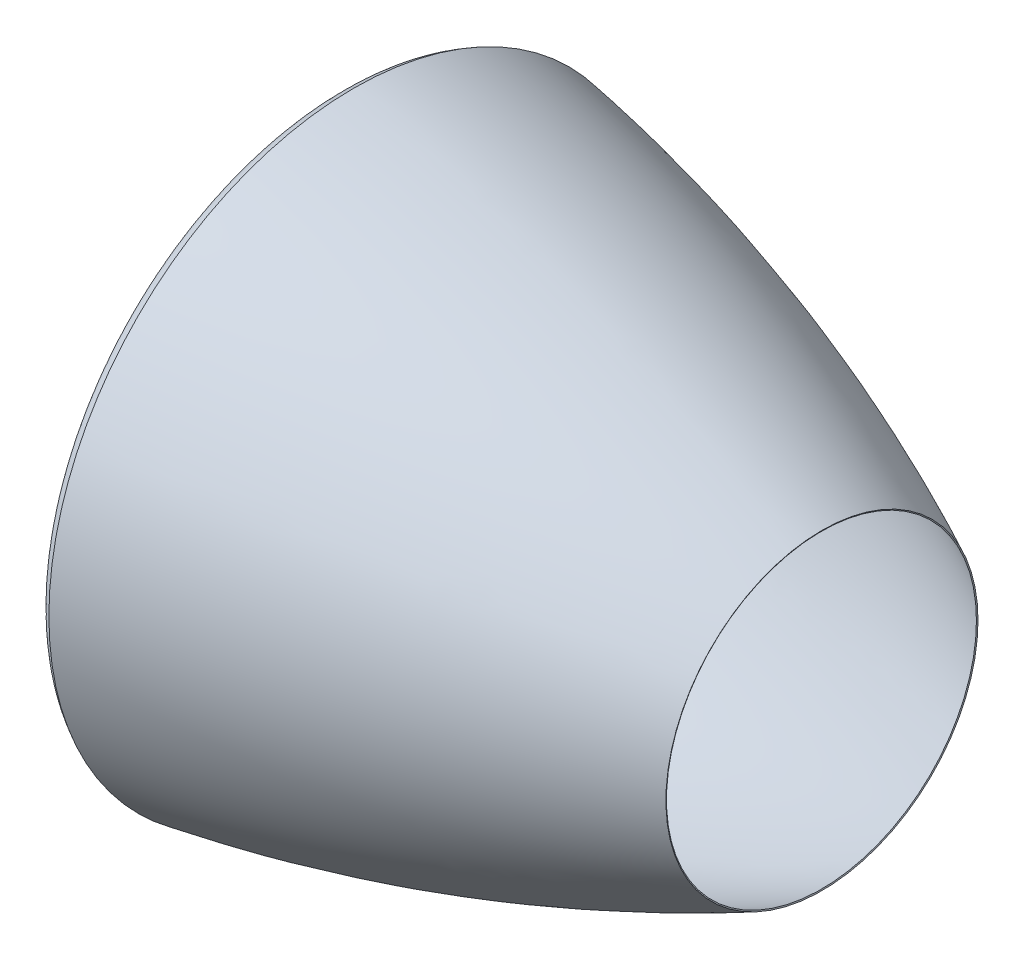
ISO-10303-21;
HEADER;
FILE_DESCRIPTION(('STEP AP214'),'2;1');
FILE_NAME('part.step','',(''),(''),'','','');
FILE_SCHEMA(('AUTOMOTIVE_DESIGN { 1 0 10303 214 1 1 1 1 }'));
ENDSEC;
DATA;
#1=APPLICATION_CONTEXT('core data for automotive mechanical design processes');
#2=APPLICATION_PROTOCOL_DEFINITION('international standard','automotive_design',2000,#1);
#3=PRODUCT_CONTEXT('',#1,'mechanical');
#4=PRODUCT('Part','Part','',(#3));
#5=PRODUCT_RELATED_PRODUCT_CATEGORY('part','',(#4));
#6=PRODUCT_DEFINITION_FORMATION('','',#4);
#7=PRODUCT_DEFINITION_CONTEXT('part definition',#1,'design');
#8=PRODUCT_DEFINITION('design','',#6,#7);
#9=PRODUCT_DEFINITION_SHAPE('','',#8);
#10=(LENGTH_UNIT() NAMED_UNIT(*) SI_UNIT(.MILLI.,.METRE.));
#11=(NAMED_UNIT(*) PLANE_ANGLE_UNIT() SI_UNIT($,.RADIAN.));
#12=(NAMED_UNIT(*) SI_UNIT($,.STERADIAN.) SOLID_ANGLE_UNIT());
#13=UNCERTAINTY_MEASURE_WITH_UNIT(LENGTH_MEASURE(1.E-05),#10,'distance_accuracy_value','');
#14=(GEOMETRIC_REPRESENTATION_CONTEXT(3) GLOBAL_UNCERTAINTY_ASSIGNED_CONTEXT((#13)) GLOBAL_UNIT_ASSIGNED_CONTEXT((#10,
#11,#12)) REPRESENTATION_CONTEXT('',''));
#15=CARTESIAN_POINT('',(0.,0.,0.));
#16=DIRECTION('',(0.,0.,1.));
#17=DIRECTION('',(1.,0.,0.));
#18=AXIS2_PLACEMENT_3D('',#15,#16,#17);
#19=CARTESIAN_POINT('',(58.1645223558109,0.,0.));
#20=DIRECTION('',(-1.,0.,0.));
#21=DIRECTION('',(0.,0.,1.));
#22=AXIS2_PLACEMENT_3D('',#19,#20,#21);
#23=PLANE('',#22);
#24=CARTESIAN_POINT('',(58.1645223558109,0.,0.));
#25=DIRECTION('',(1.,0.,0.));
#26=DIRECTION('',(0.,0.,-1.));
#27=AXIS2_PLACEMENT_3D('',#24,#25,#26);
#28=CIRCLE('',#27,1245.);
#29=CARTESIAN_POINT('',(58.1645223558109,0.,-1245.));
#30=VERTEX_POINT('',#29);
#31=EDGE_CURVE('E51',#30,#30,#28,.T.);
#32=ORIENTED_EDGE('',*,*,#31,.F.);
#33=EDGE_LOOP('',(#32));
#34=FACE_BOUND('',#33,.T.);
#35=CARTESIAN_POINT('',(58.1645223558109,0.,0.));
#36=DIRECTION('',(1.,0.,0.));
#37=DIRECTION('',(0.,0.,-1.));
#38=AXIS2_PLACEMENT_3D('',#35,#36,#37);
#39=CIRCLE('',#38,1250.);
#40=CARTESIAN_POINT('',(58.1645223558109,0.,-1250.));
#41=VERTEX_POINT('',#40);
#42=EDGE_CURVE('E114',#41,#41,#39,.T.);
#43=ORIENTED_EDGE('',*,*,#42,.T.);
#44=EDGE_LOOP('',(#43));
#45=FACE_BOUND('',#44,.T.);
#46=ADVANCED_FACE('F33',(#34,#45),#23,.F.);
#47=CARTESIAN_POINT('',(2000.,0.,0.));
#48=DIRECTION('',(1.,0.,0.));
#49=DIRECTION('',(0.,0.,-1.));
#50=AXIS2_PLACEMENT_3D('',#47,#48,#49);
#51=CONICAL_SURFACE('',#50,663.,1.11948333042552);
#52=CARTESIAN_POINT('',(2002.18073721308,0.,0.));
#53=DIRECTION('',(1.,0.,0.));
#54=DIRECTION('',(0.,1.,0.));
#55=AXIS2_PLACEMENT_3D('',#52,#53,#54);
#56=CIRCLE('',#55,667.499376090913);
#57=CARTESIAN_POINT('',(2002.18073721308,667.499376090913,0.));
#58=VERTEX_POINT('',#57);
#59=EDGE_CURVE('E10',#58,#58,#56,.T.);
#60=ORIENTED_EDGE('',*,*,#59,.T.);
#61=EDGE_LOOP('',(#60));
#62=FACE_BOUND('',#61,.T.);
#63=CARTESIAN_POINT('',(2000.,0.,0.));
#64=DIRECTION('',(1.,0.,0.));
#65=DIRECTION('',(0.,0.,-1.));
#66=AXIS2_PLACEMENT_3D('',#63,#64,#65);
#67=CIRCLE('',#66,663.);
#68=CARTESIAN_POINT('',(2000.,0.,-663.));
#69=VERTEX_POINT('',#68);
#70=EDGE_CURVE('E36',#69,#69,#67,.T.);
#71=ORIENTED_EDGE('',*,*,#70,.F.);
#72=EDGE_LOOP('',(#71));
#73=FACE_BOUND('',#72,.T.);
#74=ADVANCED_FACE('F150',(#62,#73),#51,.F.);
#75=CARTESIAN_POINT('',(2000.,663.,0.));
#76=CARTESIAN_POINT('',(1038.41146312388,1129.0583742429,0.));
#77=CARTESIAN_POINT('',(-10.3841146312388,1300.40536778039,0.));
#78=CARTESIAN_POINT('',(-20.7682292624776,1302.1018726669,0.));
#79=B_SPLINE_CURVE_WITH_KNOTS('',2,(#75,#76,#77,#78),.UNSPECIFIED.,.F.,.F.,(3,1,3),(0.,1.,1.01),.UNSPECIFIED.);
#80=CARTESIAN_POINT('',(0.,0.,0.));
#81=DIRECTION('',(1.,0.,0.));
#82=AXIS1_PLACEMENT('',#80,#81);
#83=SURFACE_OF_REVOLUTION('',#79,#82);
#84=OFFSET_SURFACE('',#83,-5.,.F.);
#85=CARTESIAN_POINT('',(-0.811020893529139,0.,0.));
#86=DIRECTION('',(1.,0.,0.));
#87=DIRECTION('',(0.,0.,-1.));
#88=AXIS2_PLACEMENT_3D('',#85,#86,#87);
#89=CIRCLE('',#88,1303.90765250978);
#90=CARTESIAN_POINT('',(-0.811020893529139,0.,-1303.90765250978));
#91=VERTEX_POINT('',#90);
#92=EDGE_CURVE('E40',#91,#91,#89,.T.);
#93=ORIENTED_EDGE('',*,*,#92,.T.);
#94=EDGE_LOOP('',(#93));
#95=FACE_BOUND('',#94,.T.);
#96=ORIENTED_EDGE('',*,*,#59,.F.);
#97=EDGE_LOOP('',(#96));
#98=FACE_BOUND('',#97,.T.);
#99=ADVANCED_FACE('F70',(#95,#98),#84,.F.);
#100=CARTESIAN_POINT('',(1.91173018426842,1299.68345446852,0.));
#101=CARTESIAN_POINT('',(0.955865092134211,1299.1961586812,0.));
#102=CARTESIAN_POINT('',(-95.5865092134211,1249.97928416188,0.));
#103=CARTESIAN_POINT('',(0.955865092134211,1199.50020715838,0.));
#104=CARTESIAN_POINT('',(1.91173018426842,1199.00041431676,0.));
#105=B_SPLINE_CURVE_WITH_KNOTS('',2,(#100,#101,#102,#103,#104),.UNSPECIFIED.,.F.,.F.,(3,1,1,3),
(-0.01,0.,1.,1.01),.UNSPECIFIED.);
#106=CARTESIAN_POINT('',(0.,0.,0.));
#107=DIRECTION('',(1.,0.,0.));
#108=AXIS1_PLACEMENT('',#106,#107);
#109=SURFACE_OF_REVOLUTION('',#105,#108);
#110=OFFSET_SURFACE('',#109,-5.,.F.);
#111=CARTESIAN_POINT('',(-1.22828908007919,0.,0.));
#112=DIRECTION('',(1.,0.,0.));
#113=DIRECTION('',(0.,0.,-1.));
#114=AXIS2_PLACEMENT_3D('',#111,#112,#113);
#115=CIRCLE('',#114,1195.);
#116=CARTESIAN_POINT('',(-1.22828908007919,0.,-1195.));
#117=VERTEX_POINT('',#116);
#118=EDGE_CURVE('E45',#117,#117,#115,.T.);
#119=ORIENTED_EDGE('',*,*,#118,.T.);
#120=EDGE_LOOP('',(#119));
#121=FACE_BOUND('',#120,.T.);
#122=ORIENTED_EDGE('',*,*,#92,.F.);
#123=EDGE_LOOP('',(#122));
#124=FACE_BOUND('',#123,.T.);
#125=ADVANCED_FACE('F71',(#121,#124),#110,.F.);
#126=CARTESIAN_POINT('',(0.,0.,0.));
#127=DIRECTION('',(1.,0.,0.));
#128=DIRECTION('',(0.,0.,-1.));
#129=AXIS2_PLACEMENT_3D('',#126,#127,#128);
#130=CYLINDRICAL_SURFACE('',#129,1195.);
#131=CARTESIAN_POINT('',(29.2497686688985,0.,0.));
#132=DIRECTION('',(1.,0.,0.));
#133=DIRECTION('',(0.,0.,-1.));
#134=AXIS2_PLACEMENT_3D('',#131,#132,#133);
#135=CIRCLE('',#134,1195.);
#136=CARTESIAN_POINT('',(29.2497686688985,0.,-1195.));
#137=VERTEX_POINT('',#136);
#138=EDGE_CURVE('E54',#137,#137,#135,.T.);
#139=ORIENTED_EDGE('',*,*,#138,.T.);
#140=EDGE_LOOP('',(#139));
#141=FACE_BOUND('',#140,.T.);
#142=ORIENTED_EDGE('',*,*,#118,.F.);
#143=EDGE_LOOP('',(#142));
#144=FACE_BOUND('',#143,.T.);
#145=ADVANCED_FACE('F74',(#141,#144),#130,.F.);
#146=CARTESIAN_POINT('',(29.9346446732899,0.,0.));
#147=DIRECTION('',(1.,0.,0.));
#148=DIRECTION('',(0.,0.,-1.));
#149=AXIS2_PLACEMENT_3D('',#146,#147,#148);
#150=CONICAL_SURFACE('',#149,1199.19421966494,1.40893440740853);
#151=CARTESIAN_POINT('',(37.4142910247094,0.,0.));
#152=DIRECTION('',(1.,0.,0.));
#153=DIRECTION('',(0.,0.,-1.));
#154=AXIS2_PLACEMENT_3D('',#151,#152,#153);
#155=CIRCLE('',#154,1245.);
#156=CARTESIAN_POINT('',(37.4142910247094,0.,-1245.));
#157=VERTEX_POINT('',#156);
#158=EDGE_CURVE('E49',#157,#157,#155,.T.);
#159=ORIENTED_EDGE('',*,*,#158,.T.);
#160=EDGE_LOOP('',(#159));
#161=FACE_BOUND('',#160,.T.);
#162=ORIENTED_EDGE('',*,*,#138,.F.);
#163=EDGE_LOOP('',(#162));
#164=FACE_BOUND('',#163,.T.);
#165=ADVANCED_FACE('F80',(#161,#164),#150,.F.);
#166=CARTESIAN_POINT('',(0.,0.,0.));
#167=DIRECTION('',(1.,0.,0.));
#168=DIRECTION('',(0.,0.,-1.));
#169=AXIS2_PLACEMENT_3D('',#166,#167,#168);
#170=CYLINDRICAL_SURFACE('',#169,1245.);
#171=ORIENTED_EDGE('',*,*,#31,.T.);
#172=EDGE_LOOP('',(#171));
#173=FACE_BOUND('',#172,.T.);
#174=ORIENTED_EDGE('',*,*,#158,.F.);
#175=EDGE_LOOP('',(#174));
#176=FACE_BOUND('',#175,.T.);
#177=ADVANCED_FACE('F84',(#173,#176),#170,.F.);
#178=CARTESIAN_POINT('',(2000.,663.,0.));
#179=CARTESIAN_POINT('',(1038.41146312388,1129.0583742429,0.));
#180=CARTESIAN_POINT('',(0.,1298.70886289388,0.));
#181=B_SPLINE_CURVE_WITH_KNOTS('',2,(#178,#179,#180),.UNSPECIFIED.,.F.,.F.,(3,3),(0.,1.),.UNSPECIFIED.);
#182=CARTESIAN_POINT('',(0.,0.,0.));
#183=DIRECTION('',(1.,0.,0.));
#184=AXIS1_PLACEMENT('',#182,#183);
#185=SURFACE_OF_REVOLUTION('',#181,#184);
#186=CARTESIAN_POINT('',(0.,0.,0.));
#187=DIRECTION('',(1.,0.,0.));
#188=DIRECTION('',(0.,0.,-1.));
#189=AXIS2_PLACEMENT_3D('',#186,#187,#188);
#190=CIRCLE('',#189,1298.70886289388);
#191=CARTESIAN_POINT('',(0.,0.,-1298.70886289388));
#192=VERTEX_POINT('',#191);
#193=EDGE_CURVE('E128',#192,#192,#190,.T.);
#194=ORIENTED_EDGE('',*,*,#193,.F.);
#195=EDGE_LOOP('',(#194));
#196=FACE_BOUND('',#195,.T.);
#197=ORIENTED_EDGE('',*,*,#70,.T.);
#198=EDGE_LOOP('',(#197));
#199=FACE_BOUND('',#198,.T.);
#200=ADVANCED_FACE('F88',(#196,#199),#185,.T.);
#201=CARTESIAN_POINT('',(0.,1298.70886289388,0.));
#202=CARTESIAN_POINT('',(-95.5865092134211,1249.97928416188,0.));
#203=CARTESIAN_POINT('',(0.,1200.,0.));
#204=B_SPLINE_CURVE_WITH_KNOTS('',2,(#201,#202,#203),.UNSPECIFIED.,.F.,.F.,(3,3),(0.,1.),.UNSPECIFIED.);
#205=CARTESIAN_POINT('',(0.,0.,0.));
#206=DIRECTION('',(1.,0.,0.));
#207=AXIS1_PLACEMENT('',#205,#206);
#208=SURFACE_OF_REVOLUTION('',#204,#207);
#209=CARTESIAN_POINT('',(0.,0.,0.));
#210=DIRECTION('',(1.,0.,0.));
#211=DIRECTION('',(0.,0.,-1.));
#212=AXIS2_PLACEMENT_3D('',#209,#210,#211);
#213=CIRCLE('',#212,1200.);
#214=CARTESIAN_POINT('',(0.,0.,-1200.));
#215=VERTEX_POINT('',#214);
#216=EDGE_CURVE('E126',#215,#215,#213,.T.);
#217=ORIENTED_EDGE('',*,*,#216,.F.);
#218=EDGE_LOOP('',(#217));
#219=FACE_BOUND('',#218,.T.);
#220=ORIENTED_EDGE('',*,*,#193,.T.);
#221=EDGE_LOOP('',(#220));
#222=FACE_BOUND('',#221,.T.);
#223=ADVANCED_FACE('F101',(#219,#222),#208,.T.);
#224=CARTESIAN_POINT('',(0.,0.,0.));
#225=DIRECTION('',(1.,0.,0.));
#226=DIRECTION('',(0.,0.,-1.));
#227=AXIS2_PLACEMENT_3D('',#224,#225,#226);
#228=CYLINDRICAL_SURFACE('',#227,1200.);
#229=CARTESIAN_POINT('',(25.,0.,0.));
#230=DIRECTION('',(1.,0.,0.));
#231=DIRECTION('',(0.,0.,-1.));
#232=AXIS2_PLACEMENT_3D('',#229,#230,#231);
#233=CIRCLE('',#232,1200.);
#234=CARTESIAN_POINT('',(25.,0.,-1200.));
#235=VERTEX_POINT('',#234);
#236=EDGE_CURVE('E120',#235,#235,#233,.T.);
#237=ORIENTED_EDGE('',*,*,#236,.F.);
#238=EDGE_LOOP('',(#237));
#239=FACE_BOUND('',#238,.T.);
#240=ORIENTED_EDGE('',*,*,#216,.T.);
#241=EDGE_LOOP('',(#240));
#242=FACE_BOUND('',#241,.T.);
#243=ADVANCED_FACE('F97',(#239,#242),#228,.T.);
#244=CARTESIAN_POINT('',(25.,0.,0.));
#245=DIRECTION('',(1.,0.,0.));
#246=DIRECTION('',(0.,0.,-1.));
#247=AXIS2_PLACEMENT_3D('',#244,#245,#246);
#248=CONICAL_SURFACE('',#247,1200.,1.40893440740853);
#249=CARTESIAN_POINT('',(33.1645223558109,0.,0.));
#250=DIRECTION('',(1.,0.,0.));
#251=DIRECTION('',(0.,0.,-1.));
#252=AXIS2_PLACEMENT_3D('',#249,#250,#251);
#253=CIRCLE('',#252,1250.);
#254=CARTESIAN_POINT('',(33.1645223558109,0.,-1250.));
#255=VERTEX_POINT('',#254);
#256=EDGE_CURVE('E121',#255,#255,#253,.T.);
#257=ORIENTED_EDGE('',*,*,#256,.F.);
#258=EDGE_LOOP('',(#257));
#259=FACE_BOUND('',#258,.T.);
#260=ORIENTED_EDGE('',*,*,#236,.T.);
#261=EDGE_LOOP('',(#260));
#262=FACE_BOUND('',#261,.T.);
#263=ADVANCED_FACE('F93',(#259,#262),#248,.T.);
#264=CARTESIAN_POINT('',(0.,0.,0.));
#265=DIRECTION('',(1.,0.,0.));
#266=DIRECTION('',(0.,0.,-1.));
#267=AXIS2_PLACEMENT_3D('',#264,#265,#266);
#268=CYLINDRICAL_SURFACE('',#267,1250.);
#269=ORIENTED_EDGE('',*,*,#42,.F.);
#270=EDGE_LOOP('',(#269));
#271=FACE_BOUND('',#270,.T.);
#272=ORIENTED_EDGE('',*,*,#256,.T.);
#273=EDGE_LOOP('',(#272));
#274=FACE_BOUND('',#273,.T.);
#275=ADVANCED_FACE('F90',(#271,#274),#268,.T.);
#276=CLOSED_SHELL('',(#46,#74,#99,#125,#145,#165,#177,#200,#223,#243,#263,#275));
#277=MANIFOLD_SOLID_BREP('B2',#276);
#278=ADVANCED_BREP_SHAPE_REPRESENTATION('',(#18,#277),#14);
#279=SHAPE_DEFINITION_REPRESENTATION(#9,#278);
ENDSEC;
END-ISO-10303-21;
